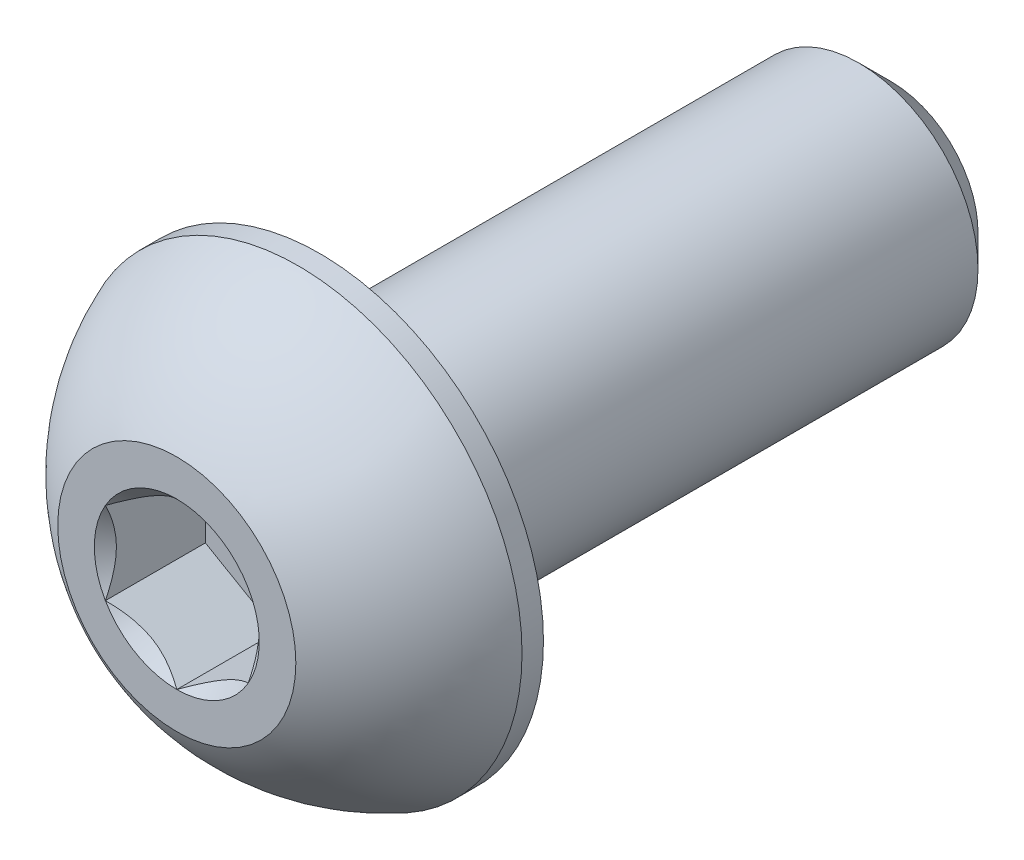
ISO-10303-21;
HEADER;
FILE_DESCRIPTION(('STEP AP214'),'2;1');
FILE_NAME('part.step','',(''),(''),'','','');
FILE_SCHEMA(('AUTOMOTIVE_DESIGN { 1 0 10303 214 1 1 1 1 }'));
ENDSEC;
DATA;
#1=APPLICATION_CONTEXT('core data for automotive mechanical design processes');
#2=APPLICATION_PROTOCOL_DEFINITION('international standard','automotive_design',2000,#1);
#3=PRODUCT_CONTEXT('',#1,'mechanical');
#4=PRODUCT('Part','Part','',(#3));
#5=PRODUCT_RELATED_PRODUCT_CATEGORY('part','',(#4));
#6=PRODUCT_DEFINITION_FORMATION('','',#4);
#7=PRODUCT_DEFINITION_CONTEXT('part definition',#1,'design');
#8=PRODUCT_DEFINITION('design','',#6,#7);
#9=PRODUCT_DEFINITION_SHAPE('','',#8);
#10=(LENGTH_UNIT() NAMED_UNIT(*) SI_UNIT(.MILLI.,.METRE.));
#11=(NAMED_UNIT(*) PLANE_ANGLE_UNIT() SI_UNIT($,.RADIAN.));
#12=(NAMED_UNIT(*) SI_UNIT($,.STERADIAN.) SOLID_ANGLE_UNIT());
#13=UNCERTAINTY_MEASURE_WITH_UNIT(LENGTH_MEASURE(1.E-05),#10,'distance_accuracy_value','');
#14=(GEOMETRIC_REPRESENTATION_CONTEXT(3) GLOBAL_UNCERTAINTY_ASSIGNED_CONTEXT((#13)) GLOBAL_UNIT_ASSIGNED_CONTEXT((#10,
#11,#12)) REPRESENTATION_CONTEXT('',''));
#15=CARTESIAN_POINT('',(0.,0.,0.));
#16=DIRECTION('',(0.,0.,1.));
#17=DIRECTION('',(1.,0.,0.));
#18=AXIS2_PLACEMENT_3D('',#15,#16,#17);
#19=CARTESIAN_POINT('',(0.,0.,-7.5));
#20=DIRECTION('',(0.,0.,1.));
#21=DIRECTION('',(0.,-1.,0.));
#22=AXIS2_PLACEMENT_3D('',#19,#20,#21);
#23=CONICAL_SURFACE('',#22,0.9125,0.785398163397446);
#24=CARTESIAN_POINT('',(0.,0.,-7.5));
#25=DIRECTION('',(0.,0.,-1.));
#26=DIRECTION('',(0.,1.,0.));
#27=AXIS2_PLACEMENT_3D('',#24,#25,#26);
#28=CIRCLE('',#27,0.9125);
#29=CARTESIAN_POINT('',(0.,0.9125,-7.5));
#30=VERTEX_POINT('',#29);
#31=EDGE_CURVE('E11',#30,#30,#28,.T.);
#32=ORIENTED_EDGE('',*,*,#31,.F.);
#33=EDGE_LOOP('',(#32));
#34=FACE_BOUND('',#33,.T.);
#35=CARTESIAN_POINT('',(0.,0.,-7.1625));
#36=DIRECTION('',(0.,0.,1.));
#37=DIRECTION('',(0.,1.,0.));
#38=AXIS2_PLACEMENT_3D('',#35,#36,#37);
#39=CIRCLE('',#38,1.25);
#40=CARTESIAN_POINT('',(0.,1.25,-7.1625));
#41=VERTEX_POINT('',#40);
#42=EDGE_CURVE('E29',#41,#41,#39,.T.);
#43=ORIENTED_EDGE('',*,*,#42,.F.);
#44=EDGE_LOOP('',(#43));
#45=FACE_BOUND('',#44,.T.);
#46=ADVANCED_FACE('F16',(#34,#45),#23,.T.);
#47=CARTESIAN_POINT('',(0.,-1.25,-7.5));
#48=DIRECTION('',(0.,0.,-1.));
#49=DIRECTION('',(-1.,0.,0.));
#50=AXIS2_PLACEMENT_3D('',#47,#48,#49);
#51=PLANE('',#50);
#52=ORIENTED_EDGE('',*,*,#31,.T.);
#53=EDGE_LOOP('',(#52));
#54=FACE_BOUND('',#53,.T.);
#55=ADVANCED_FACE('F189',(#54),#51,.T.);
#56=CARTESIAN_POINT('',(0.,0.,-7.5));
#57=DIRECTION('',(0.,0.,-1.));
#58=DIRECTION('',(0.,1.,0.));
#59=AXIS2_PLACEMENT_3D('',#56,#57,#58);
#60=CYLINDRICAL_SURFACE('',#59,1.25);
#61=ORIENTED_EDGE('',*,*,#42,.T.);
#62=EDGE_LOOP('',(#61));
#63=FACE_BOUND('',#62,.T.);
#64=CARTESIAN_POINT('',(0.,0.,-1.5));
#65=DIRECTION('',(0.,0.,-1.));
#66=DIRECTION('',(1.,0.,0.));
#67=AXIS2_PLACEMENT_3D('',#64,#65,#66);
#68=CIRCLE('',#67,1.25);
#69=CARTESIAN_POINT('',(1.25,0.,-1.5));
#70=VERTEX_POINT('',#69);
#71=EDGE_CURVE('E379',#70,#70,#68,.T.);
#72=ORIENTED_EDGE('',*,*,#71,.T.);
#73=EDGE_LOOP('',(#72));
#74=FACE_BOUND('',#73,.T.);
#75=ADVANCED_FACE('F240',(#63,#74),#60,.T.);
#76=CARTESIAN_POINT('',(-2.36,-2.35,-1.5));
#77=DIRECTION('',(0.,0.,-1.));
#78=DIRECTION('',(-1.,0.,0.));
#79=AXIS2_PLACEMENT_3D('',#76,#77,#78);
#80=PLANE('',#79);
#81=ORIENTED_EDGE('',*,*,#71,.F.);
#82=EDGE_LOOP('',(#81));
#83=FACE_BOUND('',#82,.T.);
#84=CARTESIAN_POINT('',(0.,0.,-1.5));
#85=DIRECTION('',(0.,0.,1.));
#86=DIRECTION('',(1.,0.,0.));
#87=AXIS2_PLACEMENT_3D('',#84,#85,#86);
#88=CIRCLE('',#87,2.35);
#89=CARTESIAN_POINT('',(2.35,0.,-1.5));
#90=VERTEX_POINT('',#89);
#91=EDGE_CURVE('E383',#90,#90,#88,.T.);
#92=ORIENTED_EDGE('',*,*,#91,.F.);
#93=EDGE_LOOP('',(#92));
#94=FACE_BOUND('',#93,.T.);
#95=ADVANCED_FACE('F236',(#83,#94),#80,.T.);
#96=CARTESIAN_POINT('',(0.,0.,0.));
#97=DIRECTION('',(0.,0.,1.));
#98=DIRECTION('',(1.,0.,0.));
#99=AXIS2_PLACEMENT_3D('',#96,#97,#98);
#100=CYLINDRICAL_SURFACE('',#99,2.35);
#101=CARTESIAN_POINT('',(0.,0.,-1.275));
#102=DIRECTION('',(0.,0.,1.));
#103=DIRECTION('',(1.,0.,0.));
#104=AXIS2_PLACEMENT_3D('',#101,#102,#103);
#105=CIRCLE('',#104,2.35);
#106=CARTESIAN_POINT('',(2.35,0.,-1.275));
#107=VERTEX_POINT('',#106);
#108=EDGE_CURVE('E380',#107,#107,#105,.T.);
#109=ORIENTED_EDGE('',*,*,#108,.F.);
#110=EDGE_LOOP('',(#109));
#111=FACE_BOUND('',#110,.T.);
#112=ORIENTED_EDGE('',*,*,#91,.T.);
#113=EDGE_LOOP('',(#112));
#114=FACE_BOUND('',#113,.T.);
#115=ADVANCED_FACE('F232',(#111,#114),#100,.T.);
#116=CARTESIAN_POINT('',(0.,0.,-2.19044117647059));
#117=DIRECTION('',(1.,0.,0.));
#118=DIRECTION('',(0.,-1.,0.));
#119=AXIS2_PLACEMENT_3D('',#116,#117,#118);
#120=SPHERICAL_SURFACE('',#119,2.52200962479882);
#121=CARTESIAN_POINT('',(0.,0.,-2.19044117647059));
#122=DIRECTION('',(0.,0.,1.));
#123=DIRECTION('',(1.,0.,0.));
#124=AXIS2_PLACEMENT_3D('',#121,#122,#123);
#125=SPHERICAL_SURFACE('',#124,2.52200962479882);
#126=CARTESIAN_POINT('',(0.,0.,0.));
#127=DIRECTION('',(0.,0.,1.));
#128=DIRECTION('',(1.,0.,0.));
#129=AXIS2_PLACEMENT_3D('',#126,#127,#128);
#130=CIRCLE('',#129,1.25);
#131=CARTESIAN_POINT('',(1.25,0.,0.));
#132=VERTEX_POINT('',#131);
#133=EDGE_CURVE('E264',#132,#132,#130,.T.);
#134=ORIENTED_EDGE('',*,*,#133,.F.);
#135=EDGE_LOOP('',(#134));
#136=FACE_BOUND('',#135,.T.);
#137=ORIENTED_EDGE('',*,*,#108,.T.);
#138=EDGE_LOOP('',(#137));
#139=FACE_BOUND('',#138,.T.);
#140=ADVANCED_FACE('F228',(#136,#139),#125,.T.);
#141=CARTESIAN_POINT('',(0.,-1.25,0.));
#142=DIRECTION('',(0.,0.,-1.));
#143=DIRECTION('',(0.,-1.,0.));
#144=AXIS2_PLACEMENT_3D('',#141,#142,#143);
#145=PLANE('',#144);
#146=CARTESIAN_POINT('',(0.,0.,0.));
#147=DIRECTION('',(0.,0.,1.));
#148=DIRECTION('',(1.,0.,0.));
#149=AXIS2_PLACEMENT_3D('',#146,#147,#148);
#150=CIRCLE('',#149,0.866025403784439);
#151=CARTESIAN_POINT('',(-0.75,0.433012701892219,0.));
#152=VERTEX_POINT('',#151);
#153=CARTESIAN_POINT('',(-0.75,-0.43301270189222,0.));
#154=VERTEX_POINT('',#153);
#155=EDGE_CURVE('E256',#152,#154,#150,.T.);
#156=ORIENTED_EDGE('',*,*,#155,.F.);
#157=CARTESIAN_POINT('',(0.,0.,0.));
#158=DIRECTION('',(0.,0.,1.));
#159=DIRECTION('',(1.,0.,0.));
#160=AXIS2_PLACEMENT_3D('',#157,#158,#159);
#161=CIRCLE('',#160,0.866025403784439);
#162=CARTESIAN_POINT('',(0.,0.866025403784439,0.));
#163=VERTEX_POINT('',#162);
#164=EDGE_CURVE('E207',#163,#152,#161,.T.);
#165=ORIENTED_EDGE('',*,*,#164,.F.);
#166=CARTESIAN_POINT('',(0.,0.,0.));
#167=DIRECTION('',(0.,0.,1.));
#168=DIRECTION('',(1.,0.,0.));
#169=AXIS2_PLACEMENT_3D('',#166,#167,#168);
#170=CIRCLE('',#169,0.866025403784439);
#171=CARTESIAN_POINT('',(0.75,0.433012701892219,0.));
#172=VERTEX_POINT('',#171);
#173=EDGE_CURVE('E198',#172,#163,#170,.T.);
#174=ORIENTED_EDGE('',*,*,#173,.F.);
#175=CARTESIAN_POINT('',(0.,0.,0.));
#176=DIRECTION('',(0.,0.,1.));
#177=DIRECTION('',(1.,0.,0.));
#178=AXIS2_PLACEMENT_3D('',#175,#176,#177);
#179=CIRCLE('',#178,0.866025403784439);
#180=CARTESIAN_POINT('',(0.75,-0.433012701892219,0.));
#181=VERTEX_POINT('',#180);
#182=EDGE_CURVE('E208',#181,#172,#179,.T.);
#183=ORIENTED_EDGE('',*,*,#182,.F.);
#184=CARTESIAN_POINT('',(0.,0.,0.));
#185=DIRECTION('',(0.,0.,1.));
#186=DIRECTION('',(1.,0.,0.));
#187=AXIS2_PLACEMENT_3D('',#184,#185,#186);
#188=CIRCLE('',#187,0.866025403784439);
#189=CARTESIAN_POINT('',(0.,-0.866025403784439,0.));
#190=VERTEX_POINT('',#189);
#191=EDGE_CURVE('E280',#190,#181,#188,.T.);
#192=ORIENTED_EDGE('',*,*,#191,.F.);
#193=CARTESIAN_POINT('',(0.,0.,0.));
#194=DIRECTION('',(0.,0.,1.));
#195=DIRECTION('',(1.,0.,0.));
#196=AXIS2_PLACEMENT_3D('',#193,#194,#195);
#197=CIRCLE('',#196,0.866025403784439);
#198=EDGE_CURVE('E276',#154,#190,#197,.T.);
#199=ORIENTED_EDGE('',*,*,#198,.F.);
#200=EDGE_LOOP('',(#156,#165,#174,#183,#192,#199));
#201=FACE_BOUND('',#200,.T.);
#202=ORIENTED_EDGE('',*,*,#133,.T.);
#203=EDGE_LOOP('',(#202));
#204=FACE_BOUND('',#203,.T.);
#205=ADVANCED_FACE('F231',(#201,#204),#145,.F.);
#206=CARTESIAN_POINT('',(0.,0.,0.));
#207=DIRECTION('',(0.,0.,1.));
#208=DIRECTION('',(1.,0.,0.));
#209=AXIS2_PLACEMENT_3D('',#206,#207,#208);
#210=CONICAL_SURFACE('',#209,0.866025403784439,0.78539816339745);
#211=ORIENTED_EDGE('',*,*,#155,.T.);
#212=CARTESIAN_POINT('',(-0.75,0.433012701892219,0.));
#213=CARTESIAN_POINT('',(-0.75,0.202467853991345,-0.115272423950437));
#214=CARTESIAN_POINT('',(-0.75,4.72106457010584E-05,-0.116025402298542));
#215=CARTESIAN_POINT('',(-0.75,-0.199477485688016,-0.116767608102101));
#216=CARTESIAN_POINT('',(-0.75,-0.43301270189222,0.));
#217=B_SPLINE_CURVE_WITH_KNOTS('',2,(#212,#213,#214,#215,#216),.UNSPECIFIED.,.F.,.F.,(3,2,3),
(0.,0.5,1.),.UNSPECIFIED.);
#218=EDGE_CURVE('E157',#152,#154,#217,.T.);
#219=ORIENTED_EDGE('',*,*,#218,.F.);
#220=EDGE_LOOP('',(#211,#219));
#221=FACE_BOUND('',#220,.T.);
#222=ADVANCED_FACE('F187',(#221),#210,.F.);
#223=CARTESIAN_POINT('',(0.,0.,0.));
#224=DIRECTION('',(0.,0.,1.));
#225=DIRECTION('',(1.,0.,0.));
#226=AXIS2_PLACEMENT_3D('',#223,#224,#225);
#227=CONICAL_SURFACE('',#226,0.866025403784439,0.78539816339745);
#228=ORIENTED_EDGE('',*,*,#164,.T.);
#229=CARTESIAN_POINT('',(0.,0.866025403784439,0.));
#230=CARTESIAN_POINT('',(-0.198953680178928,0.751159442976868,-0.11486596080757));
#231=CARTESIAN_POINT('',(-0.373617467333079,0.65031725844574,-0.116023704767206));
#232=CARTESIAN_POINT('',(-0.547049913819147,0.550185988780793,-0.117173286890642));
#233=CARTESIAN_POINT('',(-0.750000000000001,0.43301270189222,0.));
#234=B_SPLINE_CURVE_WITH_KNOTS('',2,(#229,#230,#231,#232,#233),.UNSPECIFIED.,.F.,.F.,(3,2,3),
(0.,0.5,1.),.UNSPECIFIED.);
#235=EDGE_CURVE('E125',#163,#152,#234,.T.);
#236=ORIENTED_EDGE('',*,*,#235,.F.);
#237=EDGE_LOOP('',(#228,#236));
#238=FACE_BOUND('',#237,.T.);
#239=ADVANCED_FACE('F182',(#238),#227,.F.);
#240=CARTESIAN_POINT('',(0.,0.,0.));
#241=DIRECTION('',(0.,0.,1.));
#242=DIRECTION('',(1.,0.,0.));
#243=AXIS2_PLACEMENT_3D('',#240,#241,#242);
#244=CONICAL_SURFACE('',#243,0.866025403784439,0.78539816339745);
#245=ORIENTED_EDGE('',*,*,#173,.T.);
#246=CARTESIAN_POINT('',(0.75,0.433012701892219,0.));
#247=CARTESIAN_POINT('',(0.551046319821072,0.547878662699791,-0.11486596080757));
#248=CARTESIAN_POINT('',(0.376382532666921,0.648720847230919,-0.116023704767206));
#249=CARTESIAN_POINT('',(0.202950086180853,0.748852116895866,-0.117173286890642));
#250=CARTESIAN_POINT('',(0.,0.866025403784439,0.));
#251=B_SPLINE_CURVE_WITH_KNOTS('',2,(#246,#247,#248,#249,#250),.UNSPECIFIED.,.F.,.F.,(3,2,3),
(0.,0.5,1.),.UNSPECIFIED.);
#252=EDGE_CURVE('E120',#172,#163,#251,.T.);
#253=ORIENTED_EDGE('',*,*,#252,.F.);
#254=EDGE_LOOP('',(#245,#253));
#255=FACE_BOUND('',#254,.T.);
#256=ADVANCED_FACE('F186',(#255),#244,.F.);
#257=CARTESIAN_POINT('',(0.,0.,0.));
#258=DIRECTION('',(0.,0.,1.));
#259=DIRECTION('',(1.,0.,0.));
#260=AXIS2_PLACEMENT_3D('',#257,#258,#259);
#261=CONICAL_SURFACE('',#260,0.866025403784439,0.78539816339745);
#262=ORIENTED_EDGE('',*,*,#182,.T.);
#263=CARTESIAN_POINT('',(0.75,-0.433012701892219,0.));
#264=CARTESIAN_POINT('',(0.75,-0.202415346005298,-0.11529867794346));
#265=CARTESIAN_POINT('',(0.75,4.72106457014921E-05,-0.116025402298541));
#266=CARTESIAN_POINT('',(0.75,0.199529841034293,-0.116741430428962));
#267=CARTESIAN_POINT('',(0.75,0.433012701892219,0.));
#268=B_SPLINE_CURVE_WITH_KNOTS('',2,(#263,#264,#265,#266,#267),.UNSPECIFIED.,.F.,.F.,(3,2,3),
(0.,0.5,1.),.UNSPECIFIED.);
#269=EDGE_CURVE('E322',#181,#172,#268,.T.);
#270=ORIENTED_EDGE('',*,*,#269,.F.);
#271=EDGE_LOOP('',(#262,#270));
#272=FACE_BOUND('',#271,.T.);
#273=ADVANCED_FACE('F304',(#272),#261,.F.);
#274=CARTESIAN_POINT('',(0.,0.,0.));
#275=DIRECTION('',(0.,0.,1.));
#276=DIRECTION('',(1.,0.,0.));
#277=AXIS2_PLACEMENT_3D('',#274,#275,#276);
#278=CONICAL_SURFACE('',#277,0.866025403784439,0.78539816339745);
#279=ORIENTED_EDGE('',*,*,#191,.T.);
#280=CARTESIAN_POINT('',(0.,-0.866025403784439,0.));
#281=CARTESIAN_POINT('',(0.198953680178929,-0.751159442976868,-0.11486596080757));
#282=CARTESIAN_POINT('',(0.373617467333079,-0.650317258445739,-0.116023704767206));
#283=CARTESIAN_POINT('',(0.547049913819146,-0.550185988780793,-0.117173286890642));
#284=CARTESIAN_POINT('',(0.75,-0.43301270189222,0.));
#285=B_SPLINE_CURVE_WITH_KNOTS('',2,(#280,#281,#282,#283,#284),.UNSPECIFIED.,.F.,.F.,(3,2,3),
(0.,0.5,1.),.UNSPECIFIED.);
#286=EDGE_CURVE('E541',#190,#181,#285,.T.);
#287=ORIENTED_EDGE('',*,*,#286,.F.);
#288=EDGE_LOOP('',(#279,#287));
#289=FACE_BOUND('',#288,.T.);
#290=ADVANCED_FACE('F180',(#289),#278,.F.);
#291=CARTESIAN_POINT('',(0.,0.,0.));
#292=DIRECTION('',(0.,0.,1.));
#293=DIRECTION('',(1.,0.,0.));
#294=AXIS2_PLACEMENT_3D('',#291,#292,#293);
#295=CONICAL_SURFACE('',#294,0.866025403784439,0.78539816339745);
#296=ORIENTED_EDGE('',*,*,#198,.T.);
#297=CARTESIAN_POINT('',(-0.75,-0.43301270189222,0.));
#298=CARTESIAN_POINT('',(-0.551046319821072,-0.54787866269979,-0.11486596080757));
#299=CARTESIAN_POINT('',(-0.376382532666921,-0.648720847230919,-0.116023704767205));
#300=CARTESIAN_POINT('',(-0.202950086180854,-0.748852116895865,-0.117173286890641));
#301=CARTESIAN_POINT('',(0.,-0.866025403784438,0.));
#302=B_SPLINE_CURVE_WITH_KNOTS('',2,(#297,#298,#299,#300,#301),.UNSPECIFIED.,.F.,.F.,(3,2,3),
(0.,0.5,1.),.UNSPECIFIED.);
#303=EDGE_CURVE('E287',#154,#190,#302,.T.);
#304=ORIENTED_EDGE('',*,*,#303,.F.);
#305=EDGE_LOOP('',(#296,#304));
#306=FACE_BOUND('',#305,.T.);
#307=ADVANCED_FACE('F173',(#306),#295,.F.);
#308=CARTESIAN_POINT('',(-0.75,0.433012701892219,-1.05));
#309=DIRECTION('',(-1.,0.,0.));
#310=DIRECTION('',(0.,0.,1.));
#311=AXIS2_PLACEMENT_3D('',#308,#309,#310);
#312=PLANE('',#311);
#313=DIRECTION('',(0.,0.,1.));
#314=VECTOR('',#313,1.);
#315=CARTESIAN_POINT('',(-0.75,0.433012701892219,-1.05));
#316=LINE('',#315,#314);
#317=CARTESIAN_POINT('',(-0.75,0.433012701892219,-1.05));
#318=VERTEX_POINT('',#317);
#319=EDGE_CURVE('E131',#318,#152,#316,.T.);
#320=ORIENTED_EDGE('',*,*,#319,.T.);
#321=ORIENTED_EDGE('',*,*,#218,.T.);
#322=DIRECTION('',(0.,0.,1.));
#323=VECTOR('',#322,1.);
#324=CARTESIAN_POINT('',(-0.75,-0.43301270189222,-1.05));
#325=LINE('',#324,#323);
#326=CARTESIAN_POINT('',(-0.75,-0.43301270189222,-1.05));
#327=VERTEX_POINT('',#326);
#328=EDGE_CURVE('E283',#327,#154,#325,.T.);
#329=ORIENTED_EDGE('',*,*,#328,.F.);
#330=DIRECTION('',(0.,-1.,0.));
#331=VECTOR('',#330,1.);
#332=CARTESIAN_POINT('',(-0.75,0.433012701892219,-1.05));
#333=LINE('',#332,#331);
#334=EDGE_CURVE('E136',#318,#327,#333,.T.);
#335=ORIENTED_EDGE('',*,*,#334,.F.);
#336=EDGE_LOOP('',(#320,#321,#329,#335));
#337=FACE_BOUND('',#336,.T.);
#338=ADVANCED_FACE('F164',(#337),#312,.F.);
#339=CARTESIAN_POINT('',(0.,0.866025403784439,-1.05));
#340=DIRECTION('',(-0.5,0.866025403784439,0.));
#341=DIRECTION('',(0.,0.,1.));
#342=AXIS2_PLACEMENT_3D('',#339,#340,#341);
#343=PLANE('',#342);
#344=DIRECTION('',(0.,0.,1.));
#345=VECTOR('',#344,1.);
#346=CARTESIAN_POINT('',(0.,0.866025403784439,-1.05));
#347=LINE('',#346,#345);
#348=CARTESIAN_POINT('',(0.,0.866025403784439,-1.05));
#349=VERTEX_POINT('',#348);
#350=EDGE_CURVE('E112',#349,#163,#347,.T.);
#351=ORIENTED_EDGE('',*,*,#350,.T.);
#352=ORIENTED_EDGE('',*,*,#235,.T.);
#353=ORIENTED_EDGE('',*,*,#319,.F.);
#354=DIRECTION('',(-0.866025403784439,-0.5,0.));
#355=VECTOR('',#354,1.);
#356=CARTESIAN_POINT('',(0.,0.866025403784439,-1.05));
#357=LINE('',#356,#355);
#358=EDGE_CURVE('E128',#349,#318,#357,.T.);
#359=ORIENTED_EDGE('',*,*,#358,.F.);
#360=EDGE_LOOP('',(#351,#352,#353,#359));
#361=FACE_BOUND('',#360,.T.);
#362=ADVANCED_FACE('F129',(#361),#343,.F.);
#363=CARTESIAN_POINT('',(0.75,0.43301270189222,-1.05));
#364=DIRECTION('',(0.5,0.866025403784439,0.));
#365=DIRECTION('',(0.,0.,-1.));
#366=AXIS2_PLACEMENT_3D('',#363,#364,#365);
#367=PLANE('',#366);
#368=DIRECTION('',(0.,0.,1.));
#369=VECTOR('',#368,1.);
#370=CARTESIAN_POINT('',(0.75,0.43301270189222,-1.05));
#371=LINE('',#370,#369);
#372=CARTESIAN_POINT('',(0.75,0.43301270189222,-1.05));
#373=VERTEX_POINT('',#372);
#374=EDGE_CURVE('E319',#373,#172,#371,.T.);
#375=ORIENTED_EDGE('',*,*,#374,.T.);
#376=ORIENTED_EDGE('',*,*,#252,.T.);
#377=ORIENTED_EDGE('',*,*,#350,.F.);
#378=DIRECTION('',(-0.866025403784439,0.5,0.));
#379=VECTOR('',#378,1.);
#380=CARTESIAN_POINT('',(0.75,0.43301270189222,-1.05));
#381=LINE('',#380,#379);
#382=EDGE_CURVE('E117',#373,#349,#381,.T.);
#383=ORIENTED_EDGE('',*,*,#382,.F.);
#384=EDGE_LOOP('',(#375,#376,#377,#383));
#385=FACE_BOUND('',#384,.T.);
#386=ADVANCED_FACE('F115',(#385),#367,.F.);
#387=CARTESIAN_POINT('',(0.75,-0.433012701892219,-1.05));
#388=DIRECTION('',(1.,0.,0.));
#389=DIRECTION('',(0.,1.,0.));
#390=AXIS2_PLACEMENT_3D('',#387,#388,#389);
#391=PLANE('',#390);
#392=DIRECTION('',(0.,0.,1.));
#393=VECTOR('',#392,1.);
#394=CARTESIAN_POINT('',(0.75,-0.433012701892219,-1.05));
#395=LINE('',#394,#393);
#396=CARTESIAN_POINT('',(0.75,-0.433012701892219,-1.05));
#397=VERTEX_POINT('',#396);
#398=EDGE_CURVE('E535',#397,#181,#395,.T.);
#399=ORIENTED_EDGE('',*,*,#398,.T.);
#400=ORIENTED_EDGE('',*,*,#269,.T.);
#401=ORIENTED_EDGE('',*,*,#374,.F.);
#402=DIRECTION('',(0.,1.,0.));
#403=VECTOR('',#402,1.);
#404=CARTESIAN_POINT('',(0.75,-0.433012701892219,-1.05));
#405=LINE('',#404,#403);
#406=EDGE_CURVE('E141',#397,#373,#405,.T.);
#407=ORIENTED_EDGE('',*,*,#406,.F.);
#408=EDGE_LOOP('',(#399,#400,#401,#407));
#409=FACE_BOUND('',#408,.T.);
#410=ADVANCED_FACE('F174',(#409),#391,.F.);
#411=CARTESIAN_POINT('',(0.,-0.866025403784439,-1.05));
#412=DIRECTION('',(0.5,-0.866025403784438,0.));
#413=DIRECTION('',(0.,0.,-1.));
#414=AXIS2_PLACEMENT_3D('',#411,#412,#413);
#415=PLANE('',#414);
#416=DIRECTION('',(0.,0.,1.));
#417=VECTOR('',#416,1.);
#418=CARTESIAN_POINT('',(0.,-0.866025403784439,-1.05));
#419=LINE('',#418,#417);
#420=CARTESIAN_POINT('',(0.,-0.866025403784439,-1.05));
#421=VERTEX_POINT('',#420);
#422=EDGE_CURVE('E368',#421,#190,#419,.T.);
#423=ORIENTED_EDGE('',*,*,#422,.T.);
#424=ORIENTED_EDGE('',*,*,#286,.T.);
#425=ORIENTED_EDGE('',*,*,#398,.F.);
#426=DIRECTION('',(0.866025403784438,0.5,0.));
#427=VECTOR('',#426,1.);
#428=CARTESIAN_POINT('',(0.,-0.866025403784439,-1.05));
#429=LINE('',#428,#427);
#430=EDGE_CURVE('E148',#421,#397,#429,.T.);
#431=ORIENTED_EDGE('',*,*,#430,.F.);
#432=EDGE_LOOP('',(#423,#424,#425,#431));
#433=FACE_BOUND('',#432,.T.);
#434=ADVANCED_FACE('F18',(#433),#415,.F.);
#435=CARTESIAN_POINT('',(-0.75,-0.43301270189222,-1.05));
#436=DIRECTION('',(-0.5,-0.866025403784439,0.));
#437=DIRECTION('',(-0.866025403784439,0.5,0.));
#438=AXIS2_PLACEMENT_3D('',#435,#436,#437);
#439=PLANE('',#438);
#440=ORIENTED_EDGE('',*,*,#328,.T.);
#441=ORIENTED_EDGE('',*,*,#303,.T.);
#442=ORIENTED_EDGE('',*,*,#422,.F.);
#443=DIRECTION('',(0.866025403784439,-0.5,0.));
#444=VECTOR('',#443,1.);
#445=CARTESIAN_POINT('',(-0.75,-0.43301270189222,-1.05));
#446=LINE('',#445,#444);
#447=EDGE_CURVE('E288',#327,#421,#446,.T.);
#448=ORIENTED_EDGE('',*,*,#447,.F.);
#449=EDGE_LOOP('',(#440,#441,#442,#448));
#450=FACE_BOUND('',#449,.T.);
#451=ADVANCED_FACE('F227',(#450),#439,.F.);
#452=CARTESIAN_POINT('',(0.75,-0.433012701892219,-1.05));
#453=DIRECTION('',(0.,0.,1.));
#454=DIRECTION('',(1.,0.,0.));
#455=AXIS2_PLACEMENT_3D('',#452,#453,#454);
#456=PLANE('',#455);
#457=ORIENTED_EDGE('',*,*,#430,.T.);
#458=ORIENTED_EDGE('',*,*,#406,.T.);
#459=ORIENTED_EDGE('',*,*,#382,.T.);
#460=ORIENTED_EDGE('',*,*,#358,.T.);
#461=ORIENTED_EDGE('',*,*,#334,.T.);
#462=ORIENTED_EDGE('',*,*,#447,.T.);
#463=EDGE_LOOP('',(#457,#458,#459,#460,#461,#462));
#464=FACE_BOUND('',#463,.T.);
#465=ADVANCED_FACE('F139',(#464),#456,.T.);
#466=CLOSED_SHELL('',(#46,#55,#75,#95,#115,#140,#205,#222,#239,#256,#273,#290,#307,#338,#362,
#386,#410,#434,#451,#465));
#467=MANIFOLD_SOLID_BREP('B1',#466);
#468=ADVANCED_BREP_SHAPE_REPRESENTATION('',(#18,#467),#14);
#469=SHAPE_DEFINITION_REPRESENTATION(#9,#468);
ENDSEC;
END-ISO-10303-21;
